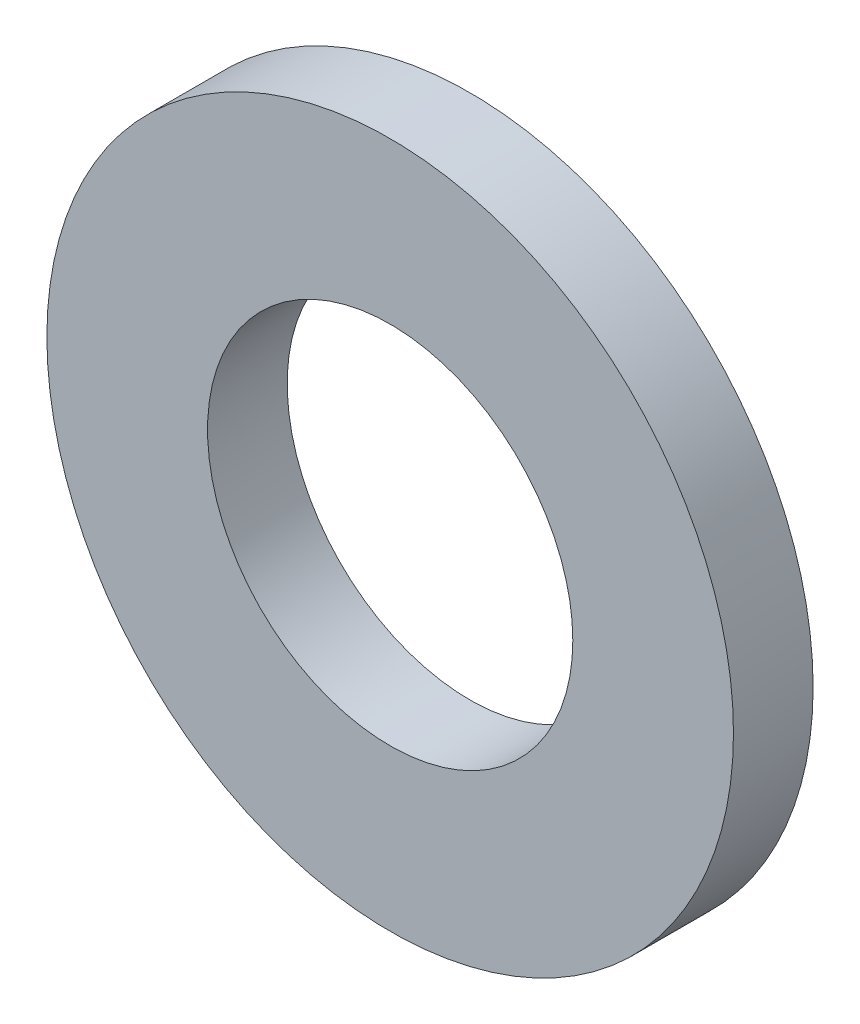
ISO-10303-21;
HEADER;
FILE_DESCRIPTION(('STEP AP214'),'2;1');
FILE_NAME('part.step','',(''),(''),'','','');
FILE_SCHEMA(('AUTOMOTIVE_DESIGN { 1 0 10303 214 1 1 1 1 }'));
ENDSEC;
DATA;
#1=APPLICATION_CONTEXT('core data for automotive mechanical design processes');
#2=APPLICATION_PROTOCOL_DEFINITION('international standard','automotive_design',2000,#1);
#3=PRODUCT_CONTEXT('',#1,'mechanical');
#4=PRODUCT('Part','Part','',(#3));
#5=PRODUCT_RELATED_PRODUCT_CATEGORY('part','',(#4));
#6=PRODUCT_DEFINITION_FORMATION('','',#4);
#7=PRODUCT_DEFINITION_CONTEXT('part definition',#1,'design');
#8=PRODUCT_DEFINITION('design','',#6,#7);
#9=PRODUCT_DEFINITION_SHAPE('','',#8);
#10=(LENGTH_UNIT() NAMED_UNIT(*) SI_UNIT(.MILLI.,.METRE.));
#11=(NAMED_UNIT(*) PLANE_ANGLE_UNIT() SI_UNIT($,.RADIAN.));
#12=(NAMED_UNIT(*) SI_UNIT($,.STERADIAN.) SOLID_ANGLE_UNIT());
#13=UNCERTAINTY_MEASURE_WITH_UNIT(LENGTH_MEASURE(1.E-05),#10,'distance_accuracy_value','');
#14=(GEOMETRIC_REPRESENTATION_CONTEXT(3) GLOBAL_UNCERTAINTY_ASSIGNED_CONTEXT((#13)) GLOBAL_UNIT_ASSIGNED_CONTEXT((#10,
#11,#12)) REPRESENTATION_CONTEXT('',''));
#15=CARTESIAN_POINT('',(0.,0.,0.));
#16=DIRECTION('',(0.,0.,1.));
#17=DIRECTION('',(1.,0.,0.));
#18=AXIS2_PLACEMENT_3D('',#15,#16,#17);
#19=CARTESIAN_POINT('',(0.,0.,1.4732));
#20=DIRECTION('',(0.,0.,1.));
#21=DIRECTION('',(1.,0.,0.));
#22=AXIS2_PLACEMENT_3D('',#19,#20,#21);
#23=PLANE('',#22);
#24=CARTESIAN_POINT('',(0.,0.,1.4732));
#25=DIRECTION('',(0.,0.,1.));
#26=DIRECTION('',(1.,0.,0.));
#27=AXIS2_PLACEMENT_3D('',#24,#25,#26);
#28=CIRCLE('',#27,6.35);
#29=CARTESIAN_POINT('',(6.35,0.,1.4732));
#30=VERTEX_POINT('',#29);
#31=EDGE_CURVE('E10',#30,#30,#28,.T.);
#32=ORIENTED_EDGE('',*,*,#31,.T.);
#33=EDGE_LOOP('',(#32));
#34=FACE_BOUND('',#33,.T.);
#35=CARTESIAN_POINT('',(0.,0.,1.4732));
#36=DIRECTION('',(0.,0.,1.));
#37=DIRECTION('',(1.,0.,0.));
#38=AXIS2_PLACEMENT_3D('',#35,#36,#37);
#39=CIRCLE('',#38,3.3782);
#40=CARTESIAN_POINT('',(3.3782,0.,1.4732));
#41=VERTEX_POINT('',#40);
#42=EDGE_CURVE('E42',#41,#41,#39,.T.);
#43=ORIENTED_EDGE('',*,*,#42,.F.);
#44=EDGE_LOOP('',(#43));
#45=FACE_BOUND('',#44,.T.);
#46=ADVANCED_FACE('F31',(#34,#45),#23,.T.);
#47=CARTESIAN_POINT('',(0.,0.,0.));
#48=DIRECTION('',(0.,0.,1.));
#49=DIRECTION('',(1.,0.,0.));
#50=AXIS2_PLACEMENT_3D('',#47,#48,#49);
#51=PLANE('',#50);
#52=CARTESIAN_POINT('',(0.,0.,0.));
#53=DIRECTION('',(0.,0.,1.));
#54=DIRECTION('',(1.,0.,0.));
#55=AXIS2_PLACEMENT_3D('',#52,#53,#54);
#56=CIRCLE('',#55,6.35);
#57=CARTESIAN_POINT('',(6.35,0.,0.));
#58=VERTEX_POINT('',#57);
#59=EDGE_CURVE('E35',#58,#58,#56,.T.);
#60=ORIENTED_EDGE('',*,*,#59,.F.);
#61=EDGE_LOOP('',(#60));
#62=FACE_BOUND('',#61,.T.);
#63=CARTESIAN_POINT('',(0.,0.,0.));
#64=DIRECTION('',(0.,0.,1.));
#65=DIRECTION('',(1.,0.,0.));
#66=AXIS2_PLACEMENT_3D('',#63,#64,#65);
#67=CIRCLE('',#66,3.3782);
#68=CARTESIAN_POINT('',(3.3782,0.,0.));
#69=VERTEX_POINT('',#68);
#70=EDGE_CURVE('E44',#69,#69,#67,.T.);
#71=ORIENTED_EDGE('',*,*,#70,.T.);
#72=EDGE_LOOP('',(#71));
#73=FACE_BOUND('',#72,.T.);
#74=ADVANCED_FACE('F54',(#62,#73),#51,.F.);
#75=CARTESIAN_POINT('',(0.,0.,1.4732));
#76=DIRECTION('',(0.,0.,-1.));
#77=DIRECTION('',(-1.,0.,0.));
#78=AXIS2_PLACEMENT_3D('',#75,#76,#77);
#79=CYLINDRICAL_SURFACE('',#78,6.35);
#80=ORIENTED_EDGE('',*,*,#31,.F.);
#81=EDGE_LOOP('',(#80));
#82=FACE_BOUND('',#81,.T.);
#83=ORIENTED_EDGE('',*,*,#59,.T.);
#84=EDGE_LOOP('',(#83));
#85=FACE_BOUND('',#84,.T.);
#86=ADVANCED_FACE('F33',(#82,#85),#79,.T.);
#87=CARTESIAN_POINT('',(0.,0.,1.4732));
#88=DIRECTION('',(0.,0.,-1.));
#89=DIRECTION('',(-1.,0.,0.));
#90=AXIS2_PLACEMENT_3D('',#87,#88,#89);
#91=CYLINDRICAL_SURFACE('',#90,3.3782);
#92=ORIENTED_EDGE('',*,*,#42,.T.);
#93=EDGE_LOOP('',(#92));
#94=FACE_BOUND('',#93,.T.);
#95=ORIENTED_EDGE('',*,*,#70,.F.);
#96=EDGE_LOOP('',(#95));
#97=FACE_BOUND('',#96,.T.);
#98=ADVANCED_FACE('F50',(#94,#97),#91,.F.);
#99=CLOSED_SHELL('',(#46,#74,#86,#98));
#100=MANIFOLD_SOLID_BREP('B2',#99);
#101=ADVANCED_BREP_SHAPE_REPRESENTATION('',(#18,#100),#14);
#102=SHAPE_DEFINITION_REPRESENTATION(#9,#101);
ENDSEC;
END-ISO-10303-21;
